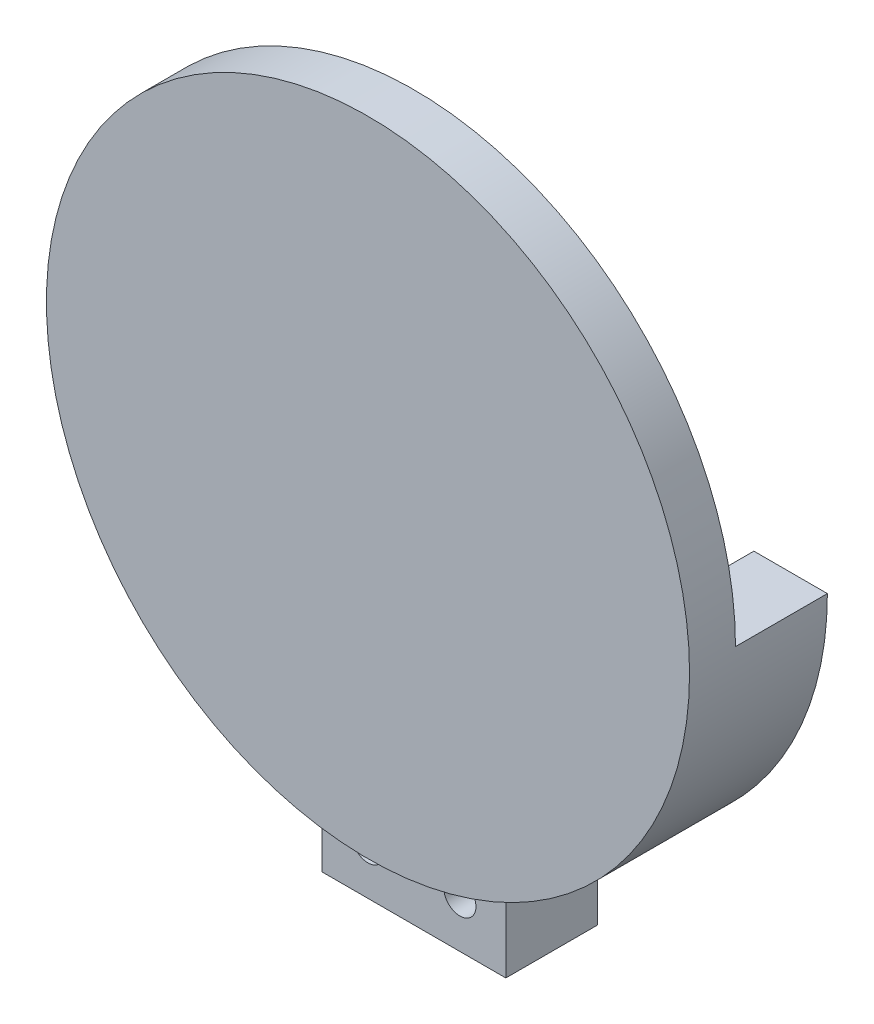
ISO-10303-21;
HEADER;
FILE_DESCRIPTION(('STEP AP214'),'2;1');
FILE_NAME('part.step','',(''),(''),'','','');
FILE_SCHEMA(('AUTOMOTIVE_DESIGN { 1 0 10303 214 1 1 1 1 }'));
ENDSEC;
DATA;
#1=APPLICATION_CONTEXT('core data for automotive mechanical design processes');
#2=APPLICATION_PROTOCOL_DEFINITION('international standard','automotive_design',2000,#1);
#3=PRODUCT_CONTEXT('',#1,'mechanical');
#4=PRODUCT('Part','Part','',(#3));
#5=PRODUCT_RELATED_PRODUCT_CATEGORY('part','',(#4));
#6=PRODUCT_DEFINITION_FORMATION('','',#4);
#7=PRODUCT_DEFINITION_CONTEXT('part definition',#1,'design');
#8=PRODUCT_DEFINITION('design','',#6,#7);
#9=PRODUCT_DEFINITION_SHAPE('','',#8);
#10=(LENGTH_UNIT() NAMED_UNIT(*) SI_UNIT(.MILLI.,.METRE.));
#11=(NAMED_UNIT(*) PLANE_ANGLE_UNIT() SI_UNIT($,.RADIAN.));
#12=(NAMED_UNIT(*) SI_UNIT($,.STERADIAN.) SOLID_ANGLE_UNIT());
#13=UNCERTAINTY_MEASURE_WITH_UNIT(LENGTH_MEASURE(1.E-05),#10,'distance_accuracy_value','');
#14=(GEOMETRIC_REPRESENTATION_CONTEXT(3) GLOBAL_UNCERTAINTY_ASSIGNED_CONTEXT((#13)) GLOBAL_UNIT_ASSIGNED_CONTEXT((#10,
#11,#12)) REPRESENTATION_CONTEXT('',''));
#15=CARTESIAN_POINT('',(0.,0.,0.));
#16=DIRECTION('',(0.,0.,1.));
#17=DIRECTION('',(1.,0.,0.));
#18=AXIS2_PLACEMENT_3D('',#15,#16,#17);
#19=CARTESIAN_POINT('',(0.,0.,9.));
#20=DIRECTION('',(0.,0.,1.));
#21=DIRECTION('',(1.,0.,0.));
#22=AXIS2_PLACEMENT_3D('',#19,#20,#21);
#23=PLANE('',#22);
#24=CARTESIAN_POINT('',(0.,0.,9.));
#25=DIRECTION('',(0.,0.,1.));
#26=DIRECTION('',(1.,0.,0.));
#27=AXIS2_PLACEMENT_3D('',#24,#25,#26);
#28=CIRCLE('',#27,6.25);
#29=CARTESIAN_POINT('',(6.25,0.,9.));
#30=VERTEX_POINT('',#29);
#31=EDGE_CURVE('E125',#30,#30,#28,.T.);
#32=ORIENTED_EDGE('',*,*,#31,.T.);
#33=EDGE_LOOP('',(#32));
#34=FACE_BOUND('',#33,.T.);
#35=DIRECTION('',(1.,0.,0.));
#36=VECTOR('',#35,1.);
#37=CARTESIAN_POINT('',(35.,0.,9.));
#38=LINE('',#37,#36);
#39=CARTESIAN_POINT('',(27.,0.,9.));
#40=VERTEX_POINT('',#39);
#41=CARTESIAN_POINT('',(35.,0.,9.));
#42=VERTEX_POINT('',#41);
#43=EDGE_CURVE('E48',#40,#42,#38,.T.);
#44=ORIENTED_EDGE('',*,*,#43,.F.);
#45=CARTESIAN_POINT('',(0.,0.,9.));
#46=DIRECTION('',(0.,0.,1.));
#47=DIRECTION('',(-1.,0.,0.));
#48=AXIS2_PLACEMENT_3D('',#45,#46,#47);
#49=CIRCLE('',#48,27.);
#50=CARTESIAN_POINT('',(-10.,-25.0798724079689,9.));
#51=VERTEX_POINT('',#50);
#52=EDGE_CURVE('E319',#51,#40,#49,.T.);
#53=ORIENTED_EDGE('',*,*,#52,.F.);
#54=DIRECTION('',(0.,1.,0.));
#55=VECTOR('',#54,1.);
#56=CARTESIAN_POINT('',(-9.9999999999997,0.,9.));
#57=LINE('',#56,#55);
#58=CARTESIAN_POINT('',(-10.,-33.5410196624969,9.));
#59=VERTEX_POINT('',#58);
#60=EDGE_CURVE('E11',#59,#51,#57,.T.);
#61=ORIENTED_EDGE('',*,*,#60,.F.);
#62=CARTESIAN_POINT('',(0.,0.,9.));
#63=DIRECTION('',(0.,0.,1.));
#64=DIRECTION('',(1.,0.,0.));
#65=AXIS2_PLACEMENT_3D('',#62,#63,#64);
#66=CIRCLE('',#65,35.);
#67=EDGE_CURVE('E115',#42,#59,#66,.T.);
#68=ORIENTED_EDGE('',*,*,#67,.F.);
#69=EDGE_LOOP('',(#44,#53,#61,#68));
#70=FACE_BOUND('',#69,.T.);
#71=ADVANCED_FACE('F33',(#34,#70),#23,.F.);
#72=CARTESIAN_POINT('',(0.,0.,7.));
#73=DIRECTION('',(0.,0.,-1.));
#74=DIRECTION('',(-1.,0.,0.));
#75=AXIS2_PLACEMENT_3D('',#72,#73,#74);
#76=CYLINDRICAL_SURFACE('',#75,4.1);
#77=CARTESIAN_POINT('',(0.,0.,7.));
#78=DIRECTION('',(0.,0.,1.));
#79=DIRECTION('',(1.,0.,0.));
#80=AXIS2_PLACEMENT_3D('',#77,#78,#79);
#81=CIRCLE('',#80,4.1);
#82=CARTESIAN_POINT('',(4.1,0.,7.));
#83=VERTEX_POINT('',#82);
#84=EDGE_CURVE('E41',#83,#83,#81,.T.);
#85=ORIENTED_EDGE('',*,*,#84,.F.);
#86=EDGE_LOOP('',(#85));
#87=FACE_BOUND('',#86,.T.);
#88=CARTESIAN_POINT('',(0.,0.,0.));
#89=DIRECTION('',(0.,0.,1.));
#90=DIRECTION('',(1.,0.,0.));
#91=AXIS2_PLACEMENT_3D('',#88,#89,#90);
#92=CIRCLE('',#91,4.1);
#93=CARTESIAN_POINT('',(4.1,0.,0.));
#94=VERTEX_POINT('',#93);
#95=EDGE_CURVE('E128',#94,#94,#92,.T.);
#96=ORIENTED_EDGE('',*,*,#95,.T.);
#97=EDGE_LOOP('',(#96));
#98=FACE_BOUND('',#97,.T.);
#99=ADVANCED_FACE('F35',(#87,#98),#76,.T.);
#100=CARTESIAN_POINT('',(0.,0.,0.));
#101=DIRECTION('',(0.,0.,1.));
#102=DIRECTION('',(1.,0.,0.));
#103=AXIS2_PLACEMENT_3D('',#100,#101,#102);
#104=PLANE('',#103);
#105=ORIENTED_EDGE('',*,*,#95,.F.);
#106=EDGE_LOOP('',(#105));
#107=FACE_BOUND('',#106,.T.);
#108=ADVANCED_FACE('F136',(#107),#104,.F.);
#109=CARTESIAN_POINT('',(0.,0.,9.));
#110=DIRECTION('',(0.,0.,-1.));
#111=DIRECTION('',(-1.,0.,0.));
#112=AXIS2_PLACEMENT_3D('',#109,#110,#111);
#113=CYLINDRICAL_SURFACE('',#112,6.25);
#114=ORIENTED_EDGE('',*,*,#31,.F.);
#115=EDGE_LOOP('',(#114));
#116=FACE_BOUND('',#115,.T.);
#117=CARTESIAN_POINT('',(0.,0.,7.));
#118=DIRECTION('',(0.,0.,1.));
#119=DIRECTION('',(1.,0.,0.));
#120=AXIS2_PLACEMENT_3D('',#117,#118,#119);
#121=CIRCLE('',#120,6.25);
#122=CARTESIAN_POINT('',(6.25,0.,7.));
#123=VERTEX_POINT('',#122);
#124=EDGE_CURVE('E123',#123,#123,#121,.T.);
#125=ORIENTED_EDGE('',*,*,#124,.T.);
#126=EDGE_LOOP('',(#125));
#127=FACE_BOUND('',#126,.T.);
#128=ADVANCED_FACE('F138',(#116,#127),#113,.T.);
#129=CARTESIAN_POINT('',(0.,0.,7.));
#130=DIRECTION('',(0.,0.,1.));
#131=DIRECTION('',(1.,0.,0.));
#132=AXIS2_PLACEMENT_3D('',#129,#130,#131);
#133=PLANE('',#132);
#134=ORIENTED_EDGE('',*,*,#84,.T.);
#135=EDGE_LOOP('',(#134));
#136=FACE_BOUND('',#135,.T.);
#137=ORIENTED_EDGE('',*,*,#124,.F.);
#138=EDGE_LOOP('',(#137));
#139=FACE_BOUND('',#138,.T.);
#140=ADVANCED_FACE('F143',(#136,#139),#133,.F.);
#141=CARTESIAN_POINT('',(0.,0.,14.));
#142=DIRECTION('',(0.,0.,-1.));
#143=DIRECTION('',(-1.,0.,0.));
#144=AXIS2_PLACEMENT_3D('',#141,#142,#143);
#145=CYLINDRICAL_SURFACE('',#144,35.);
#146=CARTESIAN_POINT('',(0.,0.,14.));
#147=DIRECTION('',(0.,0.,1.));
#148=DIRECTION('',(1.,0.,0.));
#149=AXIS2_PLACEMENT_3D('',#146,#147,#148);
#150=CIRCLE('',#149,35.);
#151=CARTESIAN_POINT('',(35.,0.,14.));
#152=VERTEX_POINT('',#151);
#153=EDGE_CURVE('E121',#152,#152,#150,.T.);
#154=ORIENTED_EDGE('',*,*,#153,.F.);
#155=EDGE_LOOP('',(#154));
#156=FACE_BOUND('',#155,.T.);
#157=ORIENTED_EDGE('',*,*,#67,.T.);
#158=CARTESIAN_POINT('',(10.,-33.5410196624969,9.));
#159=VERTEX_POINT('',#158);
#160=EDGE_CURVE('E56',#59,#159,#66,.T.);
#161=ORIENTED_EDGE('',*,*,#160,.T.);
#162=DIRECTION('',(0.,0.,1.));
#163=VECTOR('',#162,1.);
#164=CARTESIAN_POINT('',(10.,-33.5410196624969,-0.999999999999999));
#165=LINE('',#164,#163);
#166=CARTESIAN_POINT('',(10.,-33.5410196624969,-0.999999999999999));
#167=VERTEX_POINT('',#166);
#168=EDGE_CURVE('E341',#167,#159,#165,.T.);
#169=ORIENTED_EDGE('',*,*,#168,.F.);
#170=CARTESIAN_POINT('',(0.,0.,-0.999999999999999));
#171=DIRECTION('',(0.,0.,-1.));
#172=DIRECTION('',(1.,0.,0.));
#173=AXIS2_PLACEMENT_3D('',#170,#171,#172);
#174=CIRCLE('',#173,35.);
#175=CARTESIAN_POINT('',(35.,0.,-0.999999999999999));
#176=VERTEX_POINT('',#175);
#177=EDGE_CURVE('E323',#176,#167,#174,.T.);
#178=ORIENTED_EDGE('',*,*,#177,.F.);
#179=DIRECTION('',(0.,0.,1.));
#180=VECTOR('',#179,1.);
#181=CARTESIAN_POINT('',(35.,0.,-0.999999999999999));
#182=LINE('',#181,#180);
#183=EDGE_CURVE('E117',#176,#42,#182,.T.);
#184=ORIENTED_EDGE('',*,*,#183,.T.);
#185=EDGE_LOOP('',(#157,#161,#169,#178,#184));
#186=FACE_BOUND('',#185,.T.);
#187=ADVANCED_FACE('F156',(#156,#186),#145,.T.);
#188=CARTESIAN_POINT('',(0.,0.,14.));
#189=DIRECTION('',(0.,0.,1.));
#190=DIRECTION('',(1.,0.,0.));
#191=AXIS2_PLACEMENT_3D('',#188,#189,#190);
#192=PLANE('',#191);
#193=ORIENTED_EDGE('',*,*,#153,.T.);
#194=EDGE_LOOP('',(#193));
#195=FACE_BOUND('',#194,.T.);
#196=ADVANCED_FACE('F154',(#195),#192,.T.);
#197=CARTESIAN_POINT('',(0.,0.,-0.999999999999999));
#198=DIRECTION('',(0.,0.,1.));
#199=DIRECTION('',(1.,0.,0.));
#200=AXIS2_PLACEMENT_3D('',#197,#198,#199);
#201=CYLINDRICAL_SURFACE('',#200,27.);
#202=ORIENTED_EDGE('',*,*,#52,.T.);
#203=DIRECTION('',(0.,0.,1.));
#204=VECTOR('',#203,1.);
#205=CARTESIAN_POINT('',(27.,0.,-0.999999999999999));
#206=LINE('',#205,#204);
#207=CARTESIAN_POINT('',(27.,0.,-0.999999999999999));
#208=VERTEX_POINT('',#207);
#209=EDGE_CURVE('E97',#208,#40,#206,.T.);
#210=ORIENTED_EDGE('',*,*,#209,.F.);
#211=CARTESIAN_POINT('',(0.,0.,-0.999999999999999));
#212=DIRECTION('',(0.,0.,1.));
#213=DIRECTION('',(-1.,0.,0.));
#214=AXIS2_PLACEMENT_3D('',#211,#212,#213);
#215=CIRCLE('',#214,27.);
#216=CARTESIAN_POINT('',(-10.,-25.0798724079689,-0.999999999999999));
#217=VERTEX_POINT('',#216);
#218=EDGE_CURVE('E91',#217,#208,#215,.T.);
#219=ORIENTED_EDGE('',*,*,#218,.F.);
#220=DIRECTION('',(0.,0.,1.));
#221=VECTOR('',#220,1.);
#222=CARTESIAN_POINT('',(-10.,-25.0798724079689,-0.999999999999999));
#223=LINE('',#222,#221);
#224=EDGE_CURVE('E95',#217,#51,#223,.T.);
#225=ORIENTED_EDGE('',*,*,#224,.T.);
#226=EDGE_LOOP('',(#202,#210,#219,#225));
#227=FACE_BOUND('',#226,.T.);
#228=ADVANCED_FACE('F93',(#227),#201,.F.);
#229=CARTESIAN_POINT('',(35.,0.,-0.999999999999999));
#230=DIRECTION('',(0.,-1.,0.));
#231=DIRECTION('',(0.,0.,-1.));
#232=AXIS2_PLACEMENT_3D('',#229,#230,#231);
#233=PLANE('',#232);
#234=ORIENTED_EDGE('',*,*,#43,.T.);
#235=ORIENTED_EDGE('',*,*,#183,.F.);
#236=DIRECTION('',(1.,0.,0.));
#237=VECTOR('',#236,1.);
#238=CARTESIAN_POINT('',(35.,0.,-0.999999999999999));
#239=LINE('',#238,#237);
#240=EDGE_CURVE('E100',#208,#176,#239,.T.);
#241=ORIENTED_EDGE('',*,*,#240,.F.);
#242=ORIENTED_EDGE('',*,*,#209,.T.);
#243=EDGE_LOOP('',(#234,#235,#241,#242));
#244=FACE_BOUND('',#243,.T.);
#245=ADVANCED_FACE('F187',(#244),#233,.F.);
#246=CARTESIAN_POINT('',(10.,-33.7353348745793,-0.999999999999999));
#247=DIRECTION('',(-1.,0.,0.));
#248=DIRECTION('',(0.,0.,1.));
#249=AXIS2_PLACEMENT_3D('',#246,#247,#248);
#250=PLANE('',#249);
#251=DIRECTION('',(0.,-1.,0.));
#252=VECTOR('',#251,1.);
#253=CARTESIAN_POINT('',(10.,-33.7353348745793,9.));
#254=LINE('',#253,#252);
#255=CARTESIAN_POINT('',(10.,-43.7353348745793,9.));
#256=VERTEX_POINT('',#255);
#257=EDGE_CURVE('E331',#159,#256,#254,.T.);
#258=ORIENTED_EDGE('',*,*,#257,.T.);
#259=DIRECTION('',(0.,0.,1.));
#260=VECTOR('',#259,1.);
#261=CARTESIAN_POINT('',(10.,-43.7353348745793,-0.999999999999999));
#262=LINE('',#261,#260);
#263=CARTESIAN_POINT('',(10.,-43.7353348745793,-0.999999999999999));
#264=VERTEX_POINT('',#263);
#265=EDGE_CURVE('E338',#264,#256,#262,.T.);
#266=ORIENTED_EDGE('',*,*,#265,.F.);
#267=DIRECTION('',(0.,-1.,0.));
#268=VECTOR('',#267,1.);
#269=CARTESIAN_POINT('',(10.,-33.5410196624969,-0.999999999999999));
#270=LINE('',#269,#268);
#271=EDGE_CURVE('E325',#167,#264,#270,.T.);
#272=ORIENTED_EDGE('',*,*,#271,.F.);
#273=ORIENTED_EDGE('',*,*,#168,.T.);
#274=EDGE_LOOP('',(#258,#266,#272,#273));
#275=FACE_BOUND('',#274,.T.);
#276=ADVANCED_FACE('F193',(#275),#250,.F.);
#277=CARTESIAN_POINT('',(10.,-43.7353348745793,-0.999999999999999));
#278=DIRECTION('',(0.,1.,0.));
#279=DIRECTION('',(0.,0.,1.));
#280=AXIS2_PLACEMENT_3D('',#277,#278,#279);
#281=PLANE('',#280);
#282=DIRECTION('',(-1.,0.,0.));
#283=VECTOR('',#282,1.);
#284=CARTESIAN_POINT('',(10.,-43.7353348745793,9.));
#285=LINE('',#284,#283);
#286=CARTESIAN_POINT('',(-10.,-43.7353348745793,9.));
#287=VERTEX_POINT('',#286);
#288=EDGE_CURVE('E333',#256,#287,#285,.T.);
#289=ORIENTED_EDGE('',*,*,#288,.T.);
#290=DIRECTION('',(0.,0.,1.));
#291=VECTOR('',#290,1.);
#292=CARTESIAN_POINT('',(-10.,-43.7353348745793,-0.999999999999999));
#293=LINE('',#292,#291);
#294=CARTESIAN_POINT('',(-10.,-43.7353348745793,-0.999999999999999));
#295=VERTEX_POINT('',#294);
#296=EDGE_CURVE('E328',#295,#287,#293,.T.);
#297=ORIENTED_EDGE('',*,*,#296,.F.);
#298=DIRECTION('',(-1.,0.,0.));
#299=VECTOR('',#298,1.);
#300=CARTESIAN_POINT('',(10.,-43.7353348745793,-0.999999999999999));
#301=LINE('',#300,#299);
#302=EDGE_CURVE('E106',#264,#295,#301,.T.);
#303=ORIENTED_EDGE('',*,*,#302,.F.);
#304=ORIENTED_EDGE('',*,*,#265,.T.);
#305=EDGE_LOOP('',(#289,#297,#303,#304));
#306=FACE_BOUND('',#305,.T.);
#307=ADVANCED_FACE('F201',(#306),#281,.F.);
#308=CARTESIAN_POINT('',(-10.,-33.5410196624969,-0.999999999999999));
#309=DIRECTION('',(1.,0.,0.));
#310=DIRECTION('',(0.,1.,0.));
#311=AXIS2_PLACEMENT_3D('',#308,#309,#310);
#312=PLANE('',#311);
#313=DIRECTION('',(0.,1.,0.));
#314=VECTOR('',#313,1.);
#315=CARTESIAN_POINT('',(-10.,-33.5410196624969,9.));
#316=LINE('',#315,#314);
#317=EDGE_CURVE('E110',#287,#59,#316,.T.);
#318=ORIENTED_EDGE('',*,*,#317,.T.);
#319=ORIENTED_EDGE('',*,*,#60,.T.);
#320=ORIENTED_EDGE('',*,*,#224,.F.);
#321=DIRECTION('',(0.,1.,0.));
#322=VECTOR('',#321,1.);
#323=CARTESIAN_POINT('',(-10.,-33.5410196624969,-0.999999999999999));
#324=LINE('',#323,#322);
#325=EDGE_CURVE('E101',#295,#217,#324,.T.);
#326=ORIENTED_EDGE('',*,*,#325,.F.);
#327=ORIENTED_EDGE('',*,*,#296,.T.);
#328=EDGE_LOOP('',(#318,#319,#320,#326,#327));
#329=FACE_BOUND('',#328,.T.);
#330=ADVANCED_FACE('F113',(#329),#312,.F.);
#331=CARTESIAN_POINT('',(0.,0.,-0.999999999999999));
#332=DIRECTION('',(0.,0.,-1.));
#333=DIRECTION('',(-1.,0.,0.));
#334=AXIS2_PLACEMENT_3D('',#331,#332,#333);
#335=PLANE('',#334);
#336=CARTESIAN_POINT('',(5.,-38.6381772685381,-0.999999999999999));
#337=DIRECTION('',(0.,0.,-1.));
#338=DIRECTION('',(-1.,0.,0.));
#339=AXIS2_PLACEMENT_3D('',#336,#337,#338);
#340=CIRCLE('',#339,1.75);
#341=CARTESIAN_POINT('',(3.25,-38.6381772685381,-0.999999999999999));
#342=VERTEX_POINT('',#341);
#343=EDGE_CURVE('E311',#342,#342,#340,.T.);
#344=ORIENTED_EDGE('',*,*,#343,.F.);
#345=EDGE_LOOP('',(#344));
#346=FACE_BOUND('',#345,.T.);
#347=CARTESIAN_POINT('',(-5.,-38.6381772685381,-0.999999999999999));
#348=DIRECTION('',(0.,0.,-1.));
#349=DIRECTION('',(-1.,0.,0.));
#350=AXIS2_PLACEMENT_3D('',#347,#348,#349);
#351=CIRCLE('',#350,1.75);
#352=CARTESIAN_POINT('',(-6.75,-38.6381772685381,-0.999999999999999));
#353=VERTEX_POINT('',#352);
#354=EDGE_CURVE('E313',#353,#353,#351,.T.);
#355=ORIENTED_EDGE('',*,*,#354,.F.);
#356=EDGE_LOOP('',(#355));
#357=FACE_BOUND('',#356,.T.);
#358=ORIENTED_EDGE('',*,*,#325,.T.);
#359=ORIENTED_EDGE('',*,*,#218,.T.);
#360=ORIENTED_EDGE('',*,*,#240,.T.);
#361=ORIENTED_EDGE('',*,*,#177,.T.);
#362=ORIENTED_EDGE('',*,*,#271,.T.);
#363=ORIENTED_EDGE('',*,*,#302,.T.);
#364=EDGE_LOOP('',(#358,#359,#360,#361,#362,#363));
#365=FACE_BOUND('',#364,.T.);
#366=ADVANCED_FACE('F104',(#346,#357,#365),#335,.T.);
#367=CARTESIAN_POINT('',(0.,0.,9.));
#368=DIRECTION('',(0.,0.,-1.));
#369=DIRECTION('',(-1.,0.,0.));
#370=AXIS2_PLACEMENT_3D('',#367,#368,#369);
#371=PLANE('',#370);
#372=CARTESIAN_POINT('',(5.,-38.6381772685381,9.));
#373=DIRECTION('',(0.,0.,-1.));
#374=DIRECTION('',(-1.,0.,0.));
#375=AXIS2_PLACEMENT_3D('',#372,#373,#374);
#376=CIRCLE('',#375,1.75);
#377=CARTESIAN_POINT('',(3.25,-38.6381772685381,9.));
#378=VERTEX_POINT('',#377);
#379=EDGE_CURVE('E308',#378,#378,#376,.T.);
#380=ORIENTED_EDGE('',*,*,#379,.T.);
#381=EDGE_LOOP('',(#380));
#382=FACE_BOUND('',#381,.T.);
#383=CARTESIAN_POINT('',(-5.,-38.6381772685381,9.));
#384=DIRECTION('',(0.,0.,-1.));
#385=DIRECTION('',(-1.,0.,0.));
#386=AXIS2_PLACEMENT_3D('',#383,#384,#385);
#387=CIRCLE('',#386,1.75);
#388=CARTESIAN_POINT('',(-6.75,-38.6381772685381,9.));
#389=VERTEX_POINT('',#388);
#390=EDGE_CURVE('E316',#389,#389,#387,.T.);
#391=ORIENTED_EDGE('',*,*,#390,.T.);
#392=EDGE_LOOP('',(#391));
#393=FACE_BOUND('',#392,.T.);
#394=ORIENTED_EDGE('',*,*,#257,.F.);
#395=ORIENTED_EDGE('',*,*,#160,.F.);
#396=ORIENTED_EDGE('',*,*,#317,.F.);
#397=ORIENTED_EDGE('',*,*,#288,.F.);
#398=EDGE_LOOP('',(#394,#395,#396,#397));
#399=FACE_BOUND('',#398,.T.);
#400=ADVANCED_FACE('F222',(#382,#393,#399),#371,.F.);
#401=CARTESIAN_POINT('',(-5.,-38.6381772685381,9.));
#402=DIRECTION('',(0.,0.,-1.));
#403=DIRECTION('',(-1.,0.,0.));
#404=AXIS2_PLACEMENT_3D('',#401,#402,#403);
#405=CYLINDRICAL_SURFACE('',#404,1.75);
#406=ORIENTED_EDGE('',*,*,#390,.F.);
#407=EDGE_LOOP('',(#406));
#408=FACE_BOUND('',#407,.T.);
#409=ORIENTED_EDGE('',*,*,#354,.T.);
#410=EDGE_LOOP('',(#409));
#411=FACE_BOUND('',#410,.T.);
#412=ADVANCED_FACE('F230',(#408,#411),#405,.F.);
#413=CARTESIAN_POINT('',(5.,-38.6381772685381,9.));
#414=DIRECTION('',(0.,0.,-1.));
#415=DIRECTION('',(-1.,0.,0.));
#416=AXIS2_PLACEMENT_3D('',#413,#414,#415);
#417=CYLINDRICAL_SURFACE('',#416,1.75);
#418=ORIENTED_EDGE('',*,*,#379,.F.);
#419=EDGE_LOOP('',(#418));
#420=FACE_BOUND('',#419,.T.);
#421=ORIENTED_EDGE('',*,*,#343,.T.);
#422=EDGE_LOOP('',(#421));
#423=FACE_BOUND('',#422,.T.);
#424=ADVANCED_FACE('F238',(#420,#423),#417,.F.);
#425=CLOSED_SHELL('',(#71,#99,#108,#128,#140,#187,#196,#228,#245,#276,#307,#330,#366,#400,#412,#424));
#426=MANIFOLD_SOLID_BREP('B2',#425);
#427=ADVANCED_BREP_SHAPE_REPRESENTATION('',(#18,#426),#14);
#428=SHAPE_DEFINITION_REPRESENTATION(#9,#427);
ENDSEC;
END-ISO-10303-21;
